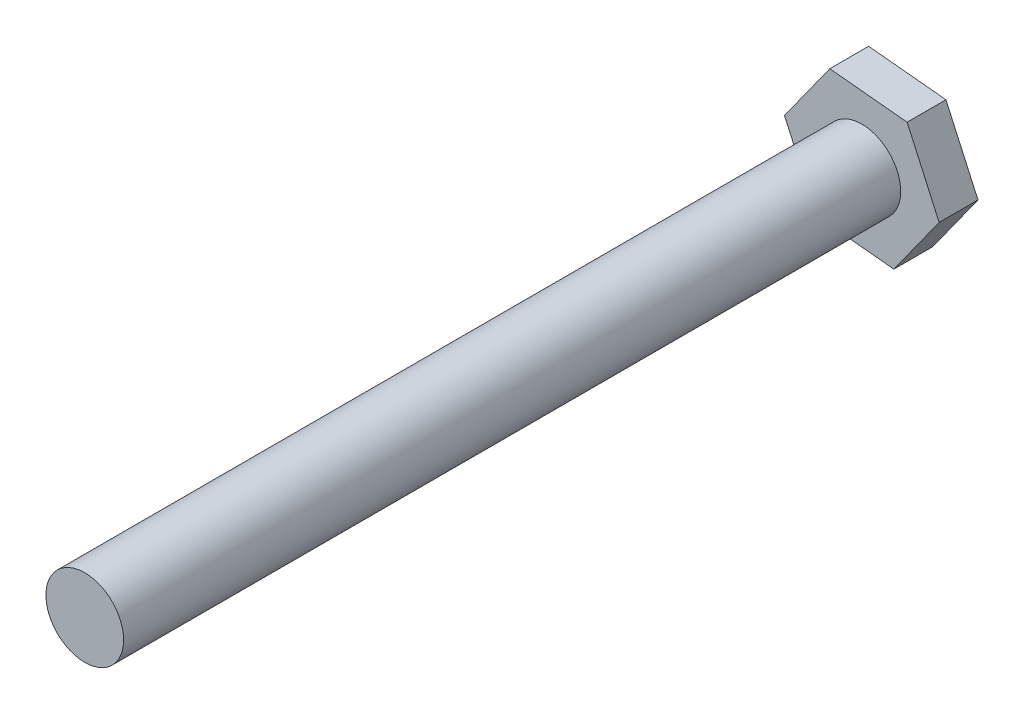
ISO-10303-21;
HEADER;
FILE_DESCRIPTION(('STEP AP214'),'2;1');
FILE_NAME('part.step','',(''),(''),'','','');
FILE_SCHEMA(('AUTOMOTIVE_DESIGN { 1 0 10303 214 1 1 1 1 }'));
ENDSEC;
DATA;
#1=APPLICATION_CONTEXT('core data for automotive mechanical design processes');
#2=APPLICATION_PROTOCOL_DEFINITION('international standard','automotive_design',2000,#1);
#3=PRODUCT_CONTEXT('',#1,'mechanical');
#4=PRODUCT('Part','Part','',(#3));
#5=PRODUCT_RELATED_PRODUCT_CATEGORY('part','',(#4));
#6=PRODUCT_DEFINITION_FORMATION('','',#4);
#7=PRODUCT_DEFINITION_CONTEXT('part definition',#1,'design');
#8=PRODUCT_DEFINITION('design','',#6,#7);
#9=PRODUCT_DEFINITION_SHAPE('','',#8);
#10=(LENGTH_UNIT() NAMED_UNIT(*) SI_UNIT(.MILLI.,.METRE.));
#11=(NAMED_UNIT(*) PLANE_ANGLE_UNIT() SI_UNIT($,.RADIAN.));
#12=(NAMED_UNIT(*) SI_UNIT($,.STERADIAN.) SOLID_ANGLE_UNIT());
#13=UNCERTAINTY_MEASURE_WITH_UNIT(LENGTH_MEASURE(1.E-05),#10,'distance_accuracy_value','');
#14=(GEOMETRIC_REPRESENTATION_CONTEXT(3) GLOBAL_UNCERTAINTY_ASSIGNED_CONTEXT((#13)) GLOBAL_UNIT_ASSIGNED_CONTEXT((#10,
#11,#12)) REPRESENTATION_CONTEXT('',''));
#15=CARTESIAN_POINT('',(0.,0.,0.));
#16=DIRECTION('',(0.,0.,1.));
#17=DIRECTION('',(1.,0.,0.));
#18=AXIS2_PLACEMENT_3D('',#15,#16,#17);
#19=CARTESIAN_POINT('',(5.97088189076893,-0.590397701966777,3.));
#20=DIRECTION('',(-0.911022375230957,-0.412356922857547,0.));
#21=DIRECTION('',(0.412356922857547,-0.911022375230957,0.));
#22=AXIS2_PLACEMENT_3D('',#19,#20,#21);
#23=PLANE('',#22);
#24=DIRECTION('',(-0.412356922857547,0.911022375230957,0.));
#25=VECTOR('',#24,1.);
#26=CARTESIAN_POINT('',(5.97088189076893,-0.590397701966777,0.));
#27=LINE('',#26,#25);
#28=CARTESIAN_POINT('',(5.97088189076893,-0.590397701966777,0.));
#29=VERTEX_POINT('',#28);
#30=CARTESIAN_POINT('',(3.49674035362365,4.87573654941896,0.));
#31=VERTEX_POINT('',#30);
#32=EDGE_CURVE('E129',#29,#31,#27,.T.);
#33=ORIENTED_EDGE('',*,*,#32,.T.);
#34=DIRECTION('',(0.,0.,-1.));
#35=VECTOR('',#34,1.);
#36=CARTESIAN_POINT('',(3.49674035362365,4.87573654941896,3.));
#37=LINE('',#36,#35);
#38=CARTESIAN_POINT('',(3.49674035362365,4.87573654941896,3.));
#39=VERTEX_POINT('',#38);
#40=EDGE_CURVE('E41',#39,#31,#37,.T.);
#41=ORIENTED_EDGE('',*,*,#40,.F.);
#42=DIRECTION('',(-0.412356922857547,0.911022375230957,0.));
#43=VECTOR('',#42,1.);
#44=CARTESIAN_POINT('',(5.97088189076893,-0.590397701966777,3.));
#45=LINE('',#44,#43);
#46=CARTESIAN_POINT('',(5.97088189076893,-0.590397701966777,3.));
#47=VERTEX_POINT('',#46);
#48=EDGE_CURVE('E146',#47,#39,#45,.T.);
#49=ORIENTED_EDGE('',*,*,#48,.F.);
#50=DIRECTION('',(0.,0.,-1.));
#51=VECTOR('',#50,1.);
#52=CARTESIAN_POINT('',(5.97088189076893,-0.590397701966777,3.));
#53=LINE('',#52,#51);
#54=EDGE_CURVE('E125',#47,#29,#53,.T.);
#55=ORIENTED_EDGE('',*,*,#54,.T.);
#56=EDGE_LOOP('',(#33,#41,#49,#55));
#57=FACE_BOUND('',#56,.T.);
#58=ADVANCED_FACE('F38',(#57),#23,.F.);
#59=CARTESIAN_POINT('',(3.49674035362365,4.87573654941896,3.));
#60=DIRECTION('',(-0.0983996169944629,-0.995146981794822,0.));
#61=DIRECTION('',(0.995146981794822,-0.0983996169944629,0.));
#62=AXIS2_PLACEMENT_3D('',#59,#60,#61);
#63=PLANE('',#62);
#64=DIRECTION('',(-0.995146981794822,0.0983996169944629,0.));
#65=VECTOR('',#64,1.);
#66=CARTESIAN_POINT('',(3.49674035362365,4.87573654941896,0.));
#67=LINE('',#66,#65);
#68=CARTESIAN_POINT('',(-2.47414153714528,5.46613425138574,0.));
#69=VERTEX_POINT('',#68);
#70=EDGE_CURVE('E133',#31,#69,#67,.T.);
#71=ORIENTED_EDGE('',*,*,#70,.T.);
#72=DIRECTION('',(0.,0.,-1.));
#73=VECTOR('',#72,1.);
#74=CARTESIAN_POINT('',(-2.47414153714528,5.46613425138574,3.));
#75=LINE('',#74,#73);
#76=CARTESIAN_POINT('',(-2.47414153714528,5.46613425138574,3.));
#77=VERTEX_POINT('',#76);
#78=EDGE_CURVE('E152',#77,#69,#75,.T.);
#79=ORIENTED_EDGE('',*,*,#78,.F.);
#80=DIRECTION('',(-0.995146981794822,0.0983996169944629,0.));
#81=VECTOR('',#80,1.);
#82=CARTESIAN_POINT('',(3.49674035362365,4.87573654941896,3.));
#83=LINE('',#82,#81);
#84=EDGE_CURVE('E94',#39,#77,#83,.T.);
#85=ORIENTED_EDGE('',*,*,#84,.F.);
#86=ORIENTED_EDGE('',*,*,#40,.T.);
#87=EDGE_LOOP('',(#71,#79,#85,#86));
#88=FACE_BOUND('',#87,.T.);
#89=ADVANCED_FACE('F159',(#88),#63,.F.);
#90=CARTESIAN_POINT('',(-2.47414153714528,5.46613425138574,3.));
#91=DIRECTION('',(0.812622758236495,-0.582790058937274,0.));
#92=DIRECTION('',(0.582790058937274,0.812622758236495,0.));
#93=AXIS2_PLACEMENT_3D('',#90,#91,#92);
#94=PLANE('',#93);
#95=DIRECTION('',(-0.582790058937274,-0.812622758236495,0.));
#96=VECTOR('',#95,1.);
#97=CARTESIAN_POINT('',(-2.47414153714528,5.46613425138574,0.));
#98=LINE('',#97,#96);
#99=CARTESIAN_POINT('',(-5.97088189076893,0.590397701966774,0.));
#100=VERTEX_POINT('',#99);
#101=EDGE_CURVE('E137',#69,#100,#98,.T.);
#102=ORIENTED_EDGE('',*,*,#101,.T.);
#103=DIRECTION('',(0.,0.,-1.));
#104=VECTOR('',#103,1.);
#105=CARTESIAN_POINT('',(-5.97088189076893,0.590397701966774,3.));
#106=LINE('',#105,#104);
#107=CARTESIAN_POINT('',(-5.97088189076893,0.590397701966774,3.));
#108=VERTEX_POINT('',#107);
#109=EDGE_CURVE('E118',#108,#100,#106,.T.);
#110=ORIENTED_EDGE('',*,*,#109,.F.);
#111=DIRECTION('',(-0.582790058937274,-0.812622758236495,0.));
#112=VECTOR('',#111,1.);
#113=CARTESIAN_POINT('',(-2.47414153714528,5.46613425138574,3.));
#114=LINE('',#113,#112);
#115=EDGE_CURVE('E107',#77,#108,#114,.T.);
#116=ORIENTED_EDGE('',*,*,#115,.F.);
#117=ORIENTED_EDGE('',*,*,#78,.T.);
#118=EDGE_LOOP('',(#102,#110,#116,#117));
#119=FACE_BOUND('',#118,.T.);
#120=ADVANCED_FACE('F165',(#119),#94,.F.);
#121=CARTESIAN_POINT('',(-5.97088189076893,0.590397701966774,3.));
#122=DIRECTION('',(0.911022375230957,0.412356922857547,0.));
#123=DIRECTION('',(-0.412356922857547,0.911022375230957,0.));
#124=AXIS2_PLACEMENT_3D('',#121,#122,#123);
#125=PLANE('',#124);
#126=DIRECTION('',(0.412356922857547,-0.911022375230957,0.));
#127=VECTOR('',#126,1.);
#128=CARTESIAN_POINT('',(-5.97088189076893,0.590397701966774,0.));
#129=LINE('',#128,#127);
#130=CARTESIAN_POINT('',(-3.49674035362364,-4.87573654941897,0.));
#131=VERTEX_POINT('',#130);
#132=EDGE_CURVE('E116',#100,#131,#129,.T.);
#133=ORIENTED_EDGE('',*,*,#132,.T.);
#134=DIRECTION('',(0.,0.,-1.));
#135=VECTOR('',#134,1.);
#136=CARTESIAN_POINT('',(-3.49674035362364,-4.87573654941897,3.));
#137=LINE('',#136,#135);
#138=CARTESIAN_POINT('',(-3.49674035362364,-4.87573654941897,3.));
#139=VERTEX_POINT('',#138);
#140=EDGE_CURVE('E113',#139,#131,#137,.T.);
#141=ORIENTED_EDGE('',*,*,#140,.F.);
#142=DIRECTION('',(0.412356922857547,-0.911022375230957,0.));
#143=VECTOR('',#142,1.);
#144=CARTESIAN_POINT('',(-5.97088189076893,0.590397701966774,3.));
#145=LINE('',#144,#143);
#146=EDGE_CURVE('E101',#108,#139,#145,.T.);
#147=ORIENTED_EDGE('',*,*,#146,.F.);
#148=ORIENTED_EDGE('',*,*,#109,.T.);
#149=EDGE_LOOP('',(#133,#141,#147,#148));
#150=FACE_BOUND('',#149,.T.);
#151=ADVANCED_FACE('F114',(#150),#125,.F.);
#152=CARTESIAN_POINT('',(-3.49674035362364,-4.87573654941897,3.));
#153=DIRECTION('',(0.0983996169944627,0.995146981794822,0.));
#154=DIRECTION('',(-0.995146981794822,0.0983996169944627,0.));
#155=AXIS2_PLACEMENT_3D('',#152,#153,#154);
#156=PLANE('',#155);
#157=DIRECTION('',(0.995146981794822,-0.0983996169944627,0.));
#158=VECTOR('',#157,1.);
#159=CARTESIAN_POINT('',(-3.49674035362364,-4.87573654941897,0.));
#160=LINE('',#159,#158);
#161=CARTESIAN_POINT('',(2.47414153714528,-5.46613425138574,0.));
#162=VERTEX_POINT('',#161);
#163=EDGE_CURVE('E79',#131,#162,#160,.T.);
#164=ORIENTED_EDGE('',*,*,#163,.T.);
#165=DIRECTION('',(0.,0.,-1.));
#166=VECTOR('',#165,1.);
#167=CARTESIAN_POINT('',(2.47414153714528,-5.46613425138574,3.));
#168=LINE('',#167,#166);
#169=CARTESIAN_POINT('',(2.47414153714528,-5.46613425138574,3.));
#170=VERTEX_POINT('',#169);
#171=EDGE_CURVE('E119',#170,#162,#168,.T.);
#172=ORIENTED_EDGE('',*,*,#171,.F.);
#173=DIRECTION('',(0.995146981794822,-0.0983996169944627,0.));
#174=VECTOR('',#173,1.);
#175=CARTESIAN_POINT('',(-3.49674035362364,-4.87573654941897,3.));
#176=LINE('',#175,#174);
#177=EDGE_CURVE('E105',#139,#170,#176,.T.);
#178=ORIENTED_EDGE('',*,*,#177,.F.);
#179=ORIENTED_EDGE('',*,*,#140,.T.);
#180=EDGE_LOOP('',(#164,#172,#178,#179));
#181=FACE_BOUND('',#180,.T.);
#182=ADVANCED_FACE('F121',(#181),#156,.F.);
#183=CARTESIAN_POINT('',(2.47414153714528,-5.46613425138574,3.));
#184=DIRECTION('',(-0.812622758236494,0.582790058937275,0.));
#185=DIRECTION('',(-0.582790058937275,-0.812622758236495,0.));
#186=AXIS2_PLACEMENT_3D('',#183,#184,#185);
#187=PLANE('',#186);
#188=DIRECTION('',(0.582790058937275,0.812622758236495,0.));
#189=VECTOR('',#188,1.);
#190=CARTESIAN_POINT('',(2.47414153714528,-5.46613425138574,0.));
#191=LINE('',#190,#189);
#192=EDGE_CURVE('E85',#162,#29,#191,.T.);
#193=ORIENTED_EDGE('',*,*,#192,.T.);
#194=ORIENTED_EDGE('',*,*,#54,.F.);
#195=DIRECTION('',(0.582790058937275,0.812622758236495,0.));
#196=VECTOR('',#195,1.);
#197=CARTESIAN_POINT('',(2.47414153714528,-5.46613425138574,3.));
#198=LINE('',#197,#196);
#199=EDGE_CURVE('E56',#170,#47,#198,.T.);
#200=ORIENTED_EDGE('',*,*,#199,.F.);
#201=ORIENTED_EDGE('',*,*,#171,.T.);
#202=EDGE_LOOP('',(#193,#194,#200,#201));
#203=FACE_BOUND('',#202,.T.);
#204=ADVANCED_FACE('F185',(#203),#187,.F.);
#205=CARTESIAN_POINT('',(0.,0.,3.));
#206=DIRECTION('',(0.,0.,1.));
#207=DIRECTION('',(1.,0.,0.));
#208=AXIS2_PLACEMENT_3D('',#205,#206,#207);
#209=PLANE('',#208);
#210=CARTESIAN_POINT('',(0.,0.,3.));
#211=DIRECTION('',(0.,0.,1.));
#212=DIRECTION('',(1.,0.,0.));
#213=AXIS2_PLACEMENT_3D('',#210,#211,#212);
#214=CIRCLE('',#213,3.);
#215=CARTESIAN_POINT('',(3.,0.,3.));
#216=VERTEX_POINT('',#215);
#217=EDGE_CURVE('E11',#216,#216,#214,.T.);
#218=ORIENTED_EDGE('',*,*,#217,.F.);
#219=EDGE_LOOP('',(#218));
#220=FACE_BOUND('',#219,.T.);
#221=ORIENTED_EDGE('',*,*,#48,.T.);
#222=ORIENTED_EDGE('',*,*,#84,.T.);
#223=ORIENTED_EDGE('',*,*,#115,.T.);
#224=ORIENTED_EDGE('',*,*,#146,.T.);
#225=ORIENTED_EDGE('',*,*,#177,.T.);
#226=ORIENTED_EDGE('',*,*,#199,.T.);
#227=EDGE_LOOP('',(#221,#222,#223,#224,#225,#226));
#228=FACE_BOUND('',#227,.T.);
#229=ADVANCED_FACE('F103',(#220,#228),#209,.T.);
#230=CARTESIAN_POINT('',(0.,0.,0.));
#231=DIRECTION('',(0.,0.,1.));
#232=DIRECTION('',(1.,0.,0.));
#233=AXIS2_PLACEMENT_3D('',#230,#231,#232);
#234=PLANE('',#233);
#235=ORIENTED_EDGE('',*,*,#32,.F.);
#236=ORIENTED_EDGE('',*,*,#192,.F.);
#237=ORIENTED_EDGE('',*,*,#163,.F.);
#238=ORIENTED_EDGE('',*,*,#132,.F.);
#239=ORIENTED_EDGE('',*,*,#101,.F.);
#240=ORIENTED_EDGE('',*,*,#70,.F.);
#241=EDGE_LOOP('',(#235,#236,#237,#238,#239,#240));
#242=FACE_BOUND('',#241,.T.);
#243=ADVANCED_FACE('F164',(#242),#234,.F.);
#244=CARTESIAN_POINT('',(0.,0.,63.));
#245=DIRECTION('',(0.,0.,-1.));
#246=DIRECTION('',(-1.,0.,0.));
#247=AXIS2_PLACEMENT_3D('',#244,#245,#246);
#248=CYLINDRICAL_SURFACE('',#247,3.);
#249=CARTESIAN_POINT('',(0.,0.,63.));
#250=DIRECTION('',(0.,0.,1.));
#251=DIRECTION('',(1.,0.,0.));
#252=AXIS2_PLACEMENT_3D('',#249,#250,#251);
#253=CIRCLE('',#252,3.);
#254=CARTESIAN_POINT('',(3.,0.,63.));
#255=VERTEX_POINT('',#254);
#256=EDGE_CURVE('E134',#255,#255,#253,.T.);
#257=ORIENTED_EDGE('',*,*,#256,.F.);
#258=EDGE_LOOP('',(#257));
#259=FACE_BOUND('',#258,.T.);
#260=ORIENTED_EDGE('',*,*,#217,.T.);
#261=EDGE_LOOP('',(#260));
#262=FACE_BOUND('',#261,.T.);
#263=ADVANCED_FACE('F178',(#259,#262),#248,.T.);
#264=CARTESIAN_POINT('',(0.,0.,63.));
#265=DIRECTION('',(0.,0.,1.));
#266=DIRECTION('',(1.,0.,0.));
#267=AXIS2_PLACEMENT_3D('',#264,#265,#266);
#268=PLANE('',#267);
#269=ORIENTED_EDGE('',*,*,#256,.T.);
#270=EDGE_LOOP('',(#269));
#271=FACE_BOUND('',#270,.T.);
#272=ADVANCED_FACE('F176',(#271),#268,.T.);
#273=CLOSED_SHELL('',(#58,#89,#120,#151,#182,#204,#229,#243,#263,#272));
#274=MANIFOLD_SOLID_BREP('B2',#273);
#275=ADVANCED_BREP_SHAPE_REPRESENTATION('',(#18,#274),#14);
#276=SHAPE_DEFINITION_REPRESENTATION(#9,#275);
ENDSEC;
END-ISO-10303-21;
